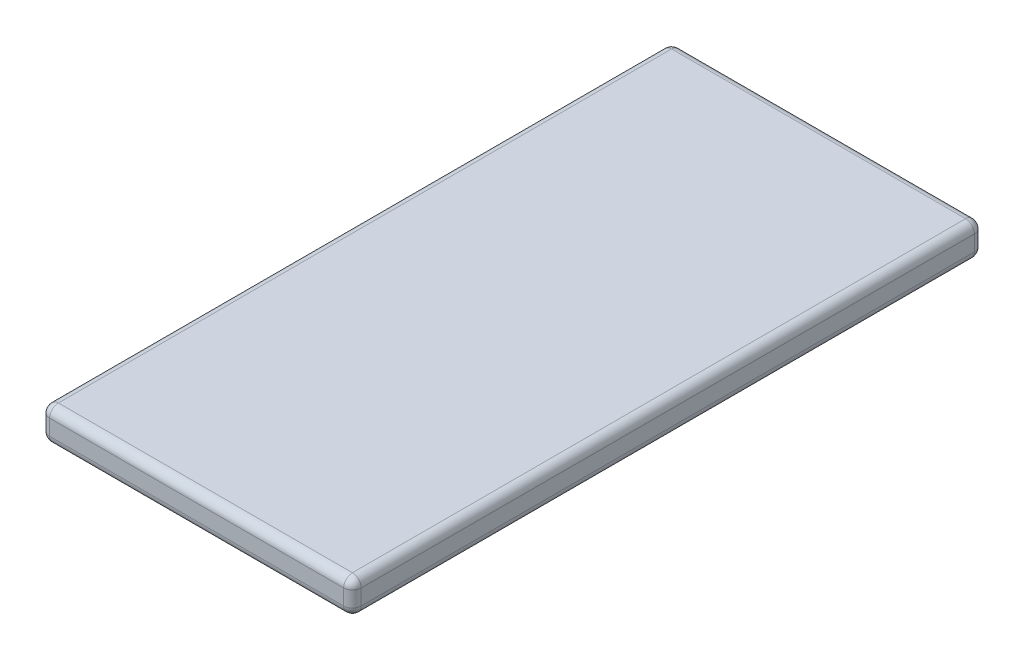
ISO-10303-21;
HEADER;
FILE_DESCRIPTION(('STEP AP214'),'2;1');
FILE_NAME('part.step','',(''),(''),'','','');
FILE_SCHEMA(('AUTOMOTIVE_DESIGN { 1 0 10303 214 1 1 1 1 }'));
ENDSEC;
DATA;
#1=APPLICATION_CONTEXT('core data for automotive mechanical design processes');
#2=APPLICATION_PROTOCOL_DEFINITION('international standard','automotive_design',2000,#1);
#3=PRODUCT_CONTEXT('',#1,'mechanical');
#4=PRODUCT('Part','Part','',(#3));
#5=PRODUCT_RELATED_PRODUCT_CATEGORY('part','',(#4));
#6=PRODUCT_DEFINITION_FORMATION('','',#4);
#7=PRODUCT_DEFINITION_CONTEXT('part definition',#1,'design');
#8=PRODUCT_DEFINITION('design','',#6,#7);
#9=PRODUCT_DEFINITION_SHAPE('','',#8);
#10=(LENGTH_UNIT() NAMED_UNIT(*) SI_UNIT(.MILLI.,.METRE.));
#11=(NAMED_UNIT(*) PLANE_ANGLE_UNIT() SI_UNIT($,.RADIAN.));
#12=(NAMED_UNIT(*) SI_UNIT($,.STERADIAN.) SOLID_ANGLE_UNIT());
#13=UNCERTAINTY_MEASURE_WITH_UNIT(LENGTH_MEASURE(1.E-05),#10,'distance_accuracy_value','');
#14=(GEOMETRIC_REPRESENTATION_CONTEXT(3) GLOBAL_UNCERTAINTY_ASSIGNED_CONTEXT((#13)) GLOBAL_UNIT_ASSIGNED_CONTEXT((#10,
#11,#12)) REPRESENTATION_CONTEXT('',''));
#15=CARTESIAN_POINT('',(0.,0.,0.));
#16=DIRECTION('',(0.,0.,1.));
#17=DIRECTION('',(1.,0.,0.));
#18=AXIS2_PLACEMENT_3D('',#15,#16,#17);
#19=CARTESIAN_POINT('',(35.47,7.56,71.795));
#20=DIRECTION('',(-1.,0.,0.));
#21=DIRECTION('',(0.,0.,1.));
#22=AXIS2_PLACEMENT_3D('',#19,#20,#21);
#23=PLANE('',#22);
#24=DIRECTION('',(0.,-1.,0.));
#25=VECTOR('',#24,1.);
#26=CARTESIAN_POINT('',(35.47,7.56,-69.795));
#27=LINE('',#26,#25);
#28=CARTESIAN_POINT('',(35.47,2.,-69.795));
#29=VERTEX_POINT('',#28);
#30=CARTESIAN_POINT('',(35.47,5.56,-69.795));
#31=VERTEX_POINT('',#30);
#32=EDGE_CURVE('E150',#29,#31,#27,.F.);
#33=ORIENTED_EDGE('',*,*,#32,.T.);
#34=DIRECTION('',(0.,0.,-1.));
#35=VECTOR('',#34,1.);
#36=CARTESIAN_POINT('',(35.47,5.56,71.795));
#37=LINE('',#36,#35);
#38=CARTESIAN_POINT('',(35.47,5.56,69.795));
#39=VERTEX_POINT('',#38);
#40=EDGE_CURVE('E153',#31,#39,#37,.F.);
#41=ORIENTED_EDGE('',*,*,#40,.T.);
#42=DIRECTION('',(0.,-1.,0.));
#43=VECTOR('',#42,1.);
#44=CARTESIAN_POINT('',(35.47,7.56,69.795));
#45=LINE('',#44,#43);
#46=CARTESIAN_POINT('',(35.47,2.,69.795));
#47=VERTEX_POINT('',#46);
#48=EDGE_CURVE('E127',#39,#47,#45,.T.);
#49=ORIENTED_EDGE('',*,*,#48,.T.);
#50=DIRECTION('',(0.,0.,-1.));
#51=VECTOR('',#50,1.);
#52=CARTESIAN_POINT('',(35.47,2.,-71.795));
#53=LINE('',#52,#51);
#54=EDGE_CURVE('E144',#47,#29,#53,.T.);
#55=ORIENTED_EDGE('',*,*,#54,.T.);
#56=EDGE_LOOP('',(#33,#41,#49,#55));
#57=FACE_BOUND('',#56,.T.);
#58=ADVANCED_FACE('F34',(#57),#23,.F.);
#59=CARTESIAN_POINT('',(-35.47,7.56,-71.795));
#60=DIRECTION('',(0.,0.,1.));
#61=DIRECTION('',(1.,0.,0.));
#62=AXIS2_PLACEMENT_3D('',#59,#60,#61);
#63=PLANE('',#62);
#64=DIRECTION('',(0.,-1.,0.));
#65=VECTOR('',#64,1.);
#66=CARTESIAN_POINT('',(-33.47,7.56,-71.795));
#67=LINE('',#66,#65);
#68=CARTESIAN_POINT('',(-33.47,2.,-71.795));
#69=VERTEX_POINT('',#68);
#70=CARTESIAN_POINT('',(-33.47,5.56,-71.795));
#71=VERTEX_POINT('',#70);
#72=EDGE_CURVE('E168',#69,#71,#67,.F.);
#73=ORIENTED_EDGE('',*,*,#72,.T.);
#74=DIRECTION('',(-1.,0.,0.));
#75=VECTOR('',#74,1.);
#76=CARTESIAN_POINT('',(-35.47,5.56,-71.795));
#77=LINE('',#76,#75);
#78=CARTESIAN_POINT('',(33.47,5.56,-71.795));
#79=VERTEX_POINT('',#78);
#80=EDGE_CURVE('E173',#71,#79,#77,.F.);
#81=ORIENTED_EDGE('',*,*,#80,.T.);
#82=DIRECTION('',(0.,-1.,0.));
#83=VECTOR('',#82,1.);
#84=CARTESIAN_POINT('',(33.47,7.56,-71.795));
#85=LINE('',#84,#83);
#86=CARTESIAN_POINT('',(33.47,2.,-71.795));
#87=VERTEX_POINT('',#86);
#88=EDGE_CURVE('E170',#79,#87,#85,.T.);
#89=ORIENTED_EDGE('',*,*,#88,.T.);
#90=DIRECTION('',(-1.,0.,0.));
#91=VECTOR('',#90,1.);
#92=CARTESIAN_POINT('',(-35.47,2.,-71.795));
#93=LINE('',#92,#91);
#94=EDGE_CURVE('E166',#87,#69,#93,.T.);
#95=ORIENTED_EDGE('',*,*,#94,.T.);
#96=EDGE_LOOP('',(#73,#81,#89,#95));
#97=FACE_BOUND('',#96,.T.);
#98=ADVANCED_FACE('F279',(#97),#63,.F.);
#99=CARTESIAN_POINT('',(-35.47,7.56,71.795));
#100=DIRECTION('',(1.,0.,0.));
#101=DIRECTION('',(0.,0.,-1.));
#102=AXIS2_PLACEMENT_3D('',#99,#100,#101);
#103=PLANE('',#102);
#104=DIRECTION('',(0.,-1.,0.));
#105=VECTOR('',#104,1.);
#106=CARTESIAN_POINT('',(-35.47,7.56,69.795));
#107=LINE('',#106,#105);
#108=CARTESIAN_POINT('',(-35.47,2.,69.795));
#109=VERTEX_POINT('',#108);
#110=CARTESIAN_POINT('',(-35.47,5.56,69.795));
#111=VERTEX_POINT('',#110);
#112=EDGE_CURVE('E177',#109,#111,#107,.F.);
#113=ORIENTED_EDGE('',*,*,#112,.T.);
#114=DIRECTION('',(0.,0.,1.));
#115=VECTOR('',#114,1.);
#116=CARTESIAN_POINT('',(-35.47,5.56,71.795));
#117=LINE('',#116,#115);
#118=CARTESIAN_POINT('',(-35.47,5.56,-69.795));
#119=VERTEX_POINT('',#118);
#120=EDGE_CURVE('E182',#111,#119,#117,.F.);
#121=ORIENTED_EDGE('',*,*,#120,.T.);
#122=DIRECTION('',(0.,-1.,0.));
#123=VECTOR('',#122,1.);
#124=CARTESIAN_POINT('',(-35.47,7.56,-69.795));
#125=LINE('',#124,#123);
#126=CARTESIAN_POINT('',(-35.47,2.,-69.795));
#127=VERTEX_POINT('',#126);
#128=EDGE_CURVE('E179',#119,#127,#125,.T.);
#129=ORIENTED_EDGE('',*,*,#128,.T.);
#130=DIRECTION('',(0.,0.,1.));
#131=VECTOR('',#130,1.);
#132=CARTESIAN_POINT('',(-35.47,2.,71.795));
#133=LINE('',#132,#131);
#134=EDGE_CURVE('E175',#127,#109,#133,.T.);
#135=ORIENTED_EDGE('',*,*,#134,.T.);
#136=EDGE_LOOP('',(#113,#121,#129,#135));
#137=FACE_BOUND('',#136,.T.);
#138=ADVANCED_FACE('F292',(#137),#103,.F.);
#139=CARTESIAN_POINT('',(-35.47,7.56,71.795));
#140=DIRECTION('',(0.,0.,-1.));
#141=DIRECTION('',(-1.,0.,0.));
#142=AXIS2_PLACEMENT_3D('',#139,#140,#141);
#143=PLANE('',#142);
#144=DIRECTION('',(0.,-1.,0.));
#145=VECTOR('',#144,1.);
#146=CARTESIAN_POINT('',(33.47,7.56,71.795));
#147=LINE('',#146,#145);
#148=CARTESIAN_POINT('',(33.47,2.,71.795));
#149=VERTEX_POINT('',#148);
#150=CARTESIAN_POINT('',(33.47,5.56,71.795));
#151=VERTEX_POINT('',#150);
#152=EDGE_CURVE('E129',#149,#151,#147,.F.);
#153=ORIENTED_EDGE('',*,*,#152,.T.);
#154=DIRECTION('',(1.,0.,0.));
#155=VECTOR('',#154,1.);
#156=CARTESIAN_POINT('',(-35.47,5.56,71.795));
#157=LINE('',#156,#155);
#158=CARTESIAN_POINT('',(-33.47,5.56,71.795));
#159=VERTEX_POINT('',#158);
#160=EDGE_CURVE('E164',#151,#159,#157,.F.);
#161=ORIENTED_EDGE('',*,*,#160,.T.);
#162=DIRECTION('',(0.,-1.,0.));
#163=VECTOR('',#162,1.);
#164=CARTESIAN_POINT('',(-33.47,7.56,71.795));
#165=LINE('',#164,#163);
#166=CARTESIAN_POINT('',(-33.47,2.,71.795));
#167=VERTEX_POINT('',#166);
#168=EDGE_CURVE('E161',#159,#167,#165,.T.);
#169=ORIENTED_EDGE('',*,*,#168,.T.);
#170=DIRECTION('',(1.,0.,0.));
#171=VECTOR('',#170,1.);
#172=CARTESIAN_POINT('',(35.47,2.,71.795));
#173=LINE('',#172,#171);
#174=EDGE_CURVE('E156',#167,#149,#173,.T.);
#175=ORIENTED_EDGE('',*,*,#174,.T.);
#176=EDGE_LOOP('',(#153,#161,#169,#175));
#177=FACE_BOUND('',#176,.T.);
#178=ADVANCED_FACE('F308',(#177),#143,.F.);
#179=CARTESIAN_POINT('',(0.,7.56,0.));
#180=DIRECTION('',(0.,-1.,0.));
#181=DIRECTION('',(0.,0.,-1.));
#182=AXIS2_PLACEMENT_3D('',#179,#180,#181);
#183=PLANE('',#182);
#184=DIRECTION('',(0.,0.,1.));
#185=VECTOR('',#184,1.);
#186=CARTESIAN_POINT('',(-33.47,7.56,0.));
#187=LINE('',#186,#185);
#188=CARTESIAN_POINT('',(-33.47,7.56,-69.795));
#189=VERTEX_POINT('',#188);
#190=CARTESIAN_POINT('',(-33.47,7.56,69.795));
#191=VERTEX_POINT('',#190);
#192=EDGE_CURVE('E188',#189,#191,#187,.T.);
#193=ORIENTED_EDGE('',*,*,#192,.T.);
#194=DIRECTION('',(1.,0.,0.));
#195=VECTOR('',#194,1.);
#196=CARTESIAN_POINT('',(0.,7.56,69.795));
#197=LINE('',#196,#195);
#198=CARTESIAN_POINT('',(33.47,7.56,69.795));
#199=VERTEX_POINT('',#198);
#200=EDGE_CURVE('E190',#191,#199,#197,.T.);
#201=ORIENTED_EDGE('',*,*,#200,.T.);
#202=DIRECTION('',(0.,0.,-1.));
#203=VECTOR('',#202,1.);
#204=CARTESIAN_POINT('',(33.47,7.56,0.));
#205=LINE('',#204,#203);
#206=CARTESIAN_POINT('',(33.47,7.56,-69.795));
#207=VERTEX_POINT('',#206);
#208=EDGE_CURVE('E184',#199,#207,#205,.T.);
#209=ORIENTED_EDGE('',*,*,#208,.T.);
#210=DIRECTION('',(-1.,0.,0.));
#211=VECTOR('',#210,1.);
#212=CARTESIAN_POINT('',(0.,7.56,-69.795));
#213=LINE('',#212,#211);
#214=EDGE_CURVE('E186',#207,#189,#213,.T.);
#215=ORIENTED_EDGE('',*,*,#214,.T.);
#216=EDGE_LOOP('',(#193,#201,#209,#215));
#217=FACE_BOUND('',#216,.T.);
#218=ADVANCED_FACE('F270',(#217),#183,.F.);
#219=CARTESIAN_POINT('',(0.,0.,0.));
#220=DIRECTION('',(0.,-1.,0.));
#221=DIRECTION('',(0.,0.,-1.));
#222=AXIS2_PLACEMENT_3D('',#219,#220,#221);
#223=PLANE('',#222);
#224=DIRECTION('',(0.,0.,1.));
#225=VECTOR('',#224,1.);
#226=CARTESIAN_POINT('',(-33.47,0.,-71.795));
#227=LINE('',#226,#225);
#228=CARTESIAN_POINT('',(-33.47,0.,69.795));
#229=VERTEX_POINT('',#228);
#230=CARTESIAN_POINT('',(-33.47,0.,-69.795));
#231=VERTEX_POINT('',#230);
#232=EDGE_CURVE('E43',#229,#231,#227,.F.);
#233=ORIENTED_EDGE('',*,*,#232,.T.);
#234=DIRECTION('',(-1.,0.,0.));
#235=VECTOR('',#234,1.);
#236=CARTESIAN_POINT('',(35.47,0.,-69.795));
#237=LINE('',#236,#235);
#238=CARTESIAN_POINT('',(33.47,0.,-69.795));
#239=VERTEX_POINT('',#238);
#240=EDGE_CURVE('E11',#231,#239,#237,.F.);
#241=ORIENTED_EDGE('',*,*,#240,.T.);
#242=DIRECTION('',(0.,0.,-1.));
#243=VECTOR('',#242,1.);
#244=CARTESIAN_POINT('',(33.47,0.,71.795));
#245=LINE('',#244,#243);
#246=CARTESIAN_POINT('',(33.47,0.,69.795));
#247=VERTEX_POINT('',#246);
#248=EDGE_CURVE('E193',#239,#247,#245,.F.);
#249=ORIENTED_EDGE('',*,*,#248,.T.);
#250=DIRECTION('',(1.,0.,0.));
#251=VECTOR('',#250,1.);
#252=CARTESIAN_POINT('',(-35.47,0.,69.795));
#253=LINE('',#252,#251);
#254=EDGE_CURVE('E54',#247,#229,#253,.F.);
#255=ORIENTED_EDGE('',*,*,#254,.T.);
#256=EDGE_LOOP('',(#233,#241,#249,#255));
#257=FACE_BOUND('',#256,.T.);
#258=ADVANCED_FACE('F479',(#257),#223,.T.);
#259=CARTESIAN_POINT('',(-33.47,7.56,-69.795));
#260=DIRECTION('',(0.,-1.,0.));
#261=DIRECTION('',(0.,0.,-1.));
#262=AXIS2_PLACEMENT_3D('',#259,#260,#261);
#263=CYLINDRICAL_SURFACE('',#262,2.);
#264=CARTESIAN_POINT('',(-33.47,5.56,-69.795));
#265=DIRECTION('',(0.,1.,0.));
#266=DIRECTION('',(0.,0.,1.));
#267=AXIS2_PLACEMENT_3D('',#264,#265,#266);
#268=CIRCLE('',#267,2.);
#269=EDGE_CURVE('E38',#71,#119,#268,.T.);
#270=ORIENTED_EDGE('',*,*,#269,.F.);
#271=ORIENTED_EDGE('',*,*,#72,.F.);
#272=CARTESIAN_POINT('',(-33.47,2.,-69.795));
#273=DIRECTION('',(0.,-1.,0.));
#274=DIRECTION('',(0.,0.,-1.));
#275=AXIS2_PLACEMENT_3D('',#272,#273,#274);
#276=CIRCLE('',#275,2.);
#277=EDGE_CURVE('E246',#127,#69,#276,.T.);
#278=ORIENTED_EDGE('',*,*,#277,.F.);
#279=ORIENTED_EDGE('',*,*,#128,.F.);
#280=EDGE_LOOP('',(#270,#271,#278,#279));
#281=FACE_BOUND('',#280,.T.);
#282=ADVANCED_FACE('F36',(#281),#263,.T.);
#283=CARTESIAN_POINT('',(-33.47,5.56,-69.795));
#284=DIRECTION('',(0.,0.,1.));
#285=DIRECTION('',(1.,0.,0.));
#286=AXIS2_PLACEMENT_3D('',#283,#284,#285);
#287=SPHERICAL_SURFACE('',#286,2.);
#288=CARTESIAN_POINT('',(-33.47,5.56,-69.795));
#289=DIRECTION('',(-1.,0.,0.));
#290=DIRECTION('',(0.,0.,1.));
#291=AXIS2_PLACEMENT_3D('',#288,#289,#290);
#292=CIRCLE('',#291,2.);
#293=EDGE_CURVE('E241',#71,#189,#292,.F.);
#294=ORIENTED_EDGE('',*,*,#293,.F.);
#295=ORIENTED_EDGE('',*,*,#269,.T.);
#296=CARTESIAN_POINT('',(-33.47,5.56,-69.795));
#297=DIRECTION('',(0.,0.,-1.));
#298=DIRECTION('',(-1.,0.,0.));
#299=AXIS2_PLACEMENT_3D('',#296,#297,#298);
#300=CIRCLE('',#299,2.);
#301=EDGE_CURVE('E244',#189,#119,#300,.F.);
#302=ORIENTED_EDGE('',*,*,#301,.F.);
#303=EDGE_LOOP('',(#294,#295,#302));
#304=FACE_BOUND('',#303,.T.);
#305=ADVANCED_FACE('F257',(#304),#287,.T.);
#306=CARTESIAN_POINT('',(-33.47,2.,-69.795));
#307=DIRECTION('',(0.,0.,1.));
#308=DIRECTION('',(1.,0.,0.));
#309=AXIS2_PLACEMENT_3D('',#306,#307,#308);
#310=SPHERICAL_SURFACE('',#309,2.);
#311=CARTESIAN_POINT('',(-33.47,2.,-69.795));
#312=DIRECTION('',(0.,0.,-1.));
#313=DIRECTION('',(-1.,0.,0.));
#314=AXIS2_PLACEMENT_3D('',#311,#312,#313);
#315=CIRCLE('',#314,2.);
#316=EDGE_CURVE('E236',#127,#231,#315,.F.);
#317=ORIENTED_EDGE('',*,*,#316,.F.);
#318=ORIENTED_EDGE('',*,*,#277,.T.);
#319=CARTESIAN_POINT('',(-33.47,2.,-69.795));
#320=DIRECTION('',(-1.,0.,0.));
#321=DIRECTION('',(0.,0.,1.));
#322=AXIS2_PLACEMENT_3D('',#319,#320,#321);
#323=CIRCLE('',#322,2.);
#324=EDGE_CURVE('E238',#231,#69,#323,.F.);
#325=ORIENTED_EDGE('',*,*,#324,.F.);
#326=EDGE_LOOP('',(#317,#318,#325));
#327=FACE_BOUND('',#326,.T.);
#328=ADVANCED_FACE('F458',(#327),#310,.T.);
#329=CARTESIAN_POINT('',(-33.47,5.56,0.));
#330=DIRECTION('',(0.,0.,1.));
#331=DIRECTION('',(1.,0.,0.));
#332=AXIS2_PLACEMENT_3D('',#329,#330,#331);
#333=CYLINDRICAL_SURFACE('',#332,2.);
#334=ORIENTED_EDGE('',*,*,#301,.T.);
#335=ORIENTED_EDGE('',*,*,#120,.F.);
#336=CARTESIAN_POINT('',(-33.47,5.56,69.795));
#337=DIRECTION('',(0.,0.,1.));
#338=DIRECTION('',(1.,0.,0.));
#339=AXIS2_PLACEMENT_3D('',#336,#337,#338);
#340=CIRCLE('',#339,2.);
#341=EDGE_CURVE('E230',#191,#111,#340,.T.);
#342=ORIENTED_EDGE('',*,*,#341,.F.);
#343=ORIENTED_EDGE('',*,*,#192,.F.);
#344=EDGE_LOOP('',(#334,#335,#342,#343));
#345=FACE_BOUND('',#344,.T.);
#346=ADVANCED_FACE('F265',(#345),#333,.T.);
#347=CARTESIAN_POINT('',(0.,5.56,-69.795));
#348=DIRECTION('',(-1.,0.,0.));
#349=DIRECTION('',(0.,0.,1.));
#350=AXIS2_PLACEMENT_3D('',#347,#348,#349);
#351=CYLINDRICAL_SURFACE('',#350,2.);
#352=ORIENTED_EDGE('',*,*,#293,.T.);
#353=ORIENTED_EDGE('',*,*,#214,.F.);
#354=CARTESIAN_POINT('',(33.47,5.56,-69.795));
#355=DIRECTION('',(1.,0.,0.));
#356=DIRECTION('',(0.,0.,-1.));
#357=AXIS2_PLACEMENT_3D('',#354,#355,#356);
#358=CIRCLE('',#357,2.);
#359=EDGE_CURVE('E227',#79,#207,#358,.T.);
#360=ORIENTED_EDGE('',*,*,#359,.F.);
#361=ORIENTED_EDGE('',*,*,#80,.F.);
#362=EDGE_LOOP('',(#352,#353,#360,#361));
#363=FACE_BOUND('',#362,.T.);
#364=ADVANCED_FACE('F276',(#363),#351,.T.);
#365=CARTESIAN_POINT('',(33.47,7.56,-69.795));
#366=DIRECTION('',(0.,-1.,0.));
#367=DIRECTION('',(0.,0.,-1.));
#368=AXIS2_PLACEMENT_3D('',#365,#366,#367);
#369=CYLINDRICAL_SURFACE('',#368,2.);
#370=CARTESIAN_POINT('',(33.47,2.,-69.795));
#371=DIRECTION('',(0.,-1.,0.));
#372=DIRECTION('',(0.,0.,-1.));
#373=AXIS2_PLACEMENT_3D('',#370,#371,#372);
#374=CIRCLE('',#373,2.);
#375=EDGE_CURVE('E221',#87,#29,#374,.T.);
#376=ORIENTED_EDGE('',*,*,#375,.F.);
#377=ORIENTED_EDGE('',*,*,#88,.F.);
#378=CARTESIAN_POINT('',(33.47,5.56,-69.795));
#379=DIRECTION('',(0.,1.,0.));
#380=DIRECTION('',(0.,0.,1.));
#381=AXIS2_PLACEMENT_3D('',#378,#379,#380);
#382=CIRCLE('',#381,2.);
#383=EDGE_CURVE('E224',#31,#79,#382,.T.);
#384=ORIENTED_EDGE('',*,*,#383,.F.);
#385=ORIENTED_EDGE('',*,*,#32,.F.);
#386=EDGE_LOOP('',(#376,#377,#384,#385));
#387=FACE_BOUND('',#386,.T.);
#388=ADVANCED_FACE('F283',(#387),#369,.T.);
#389=CARTESIAN_POINT('',(-35.47,2.,-69.795));
#390=DIRECTION('',(1.,0.,0.));
#391=DIRECTION('',(0.,0.,-1.));
#392=AXIS2_PLACEMENT_3D('',#389,#390,#391);
#393=CYLINDRICAL_SURFACE('',#392,2.);
#394=ORIENTED_EDGE('',*,*,#324,.T.);
#395=ORIENTED_EDGE('',*,*,#94,.F.);
#396=CARTESIAN_POINT('',(33.47,2.,-69.795));
#397=DIRECTION('',(1.,0.,0.));
#398=DIRECTION('',(0.,0.,-1.));
#399=AXIS2_PLACEMENT_3D('',#396,#397,#398);
#400=CIRCLE('',#399,2.);
#401=EDGE_CURVE('E219',#239,#87,#400,.T.);
#402=ORIENTED_EDGE('',*,*,#401,.F.);
#403=ORIENTED_EDGE('',*,*,#240,.F.);
#404=EDGE_LOOP('',(#394,#395,#402,#403));
#405=FACE_BOUND('',#404,.T.);
#406=ADVANCED_FACE('F289',(#405),#393,.T.);
#407=CARTESIAN_POINT('',(-33.47,2.,71.795));
#408=DIRECTION('',(0.,0.,-1.));
#409=DIRECTION('',(-1.,0.,0.));
#410=AXIS2_PLACEMENT_3D('',#407,#408,#409);
#411=CYLINDRICAL_SURFACE('',#410,2.);
#412=ORIENTED_EDGE('',*,*,#316,.T.);
#413=ORIENTED_EDGE('',*,*,#232,.F.);
#414=CARTESIAN_POINT('',(-33.47,2.,69.795));
#415=DIRECTION('',(0.,0.,1.));
#416=DIRECTION('',(1.,0.,0.));
#417=AXIS2_PLACEMENT_3D('',#414,#415,#416);
#418=CIRCLE('',#417,2.);
#419=EDGE_CURVE('E216',#109,#229,#418,.T.);
#420=ORIENTED_EDGE('',*,*,#419,.F.);
#421=ORIENTED_EDGE('',*,*,#134,.F.);
#422=EDGE_LOOP('',(#412,#413,#420,#421));
#423=FACE_BOUND('',#422,.T.);
#424=ADVANCED_FACE('F301',(#423),#411,.T.);
#425=CARTESIAN_POINT('',(-33.47,7.56,69.795));
#426=DIRECTION('',(0.,-1.,0.));
#427=DIRECTION('',(0.,0.,-1.));
#428=AXIS2_PLACEMENT_3D('',#425,#426,#427);
#429=CYLINDRICAL_SURFACE('',#428,2.);
#430=CARTESIAN_POINT('',(-33.47,5.56,69.795));
#431=DIRECTION('',(0.,1.,0.));
#432=DIRECTION('',(0.,0.,1.));
#433=AXIS2_PLACEMENT_3D('',#430,#431,#432);
#434=CIRCLE('',#433,2.);
#435=EDGE_CURVE('E233',#111,#159,#434,.T.);
#436=ORIENTED_EDGE('',*,*,#435,.F.);
#437=ORIENTED_EDGE('',*,*,#112,.F.);
#438=CARTESIAN_POINT('',(-33.47,2.,69.795));
#439=DIRECTION('',(0.,-1.,0.));
#440=DIRECTION('',(0.,0.,-1.));
#441=AXIS2_PLACEMENT_3D('',#438,#439,#440);
#442=CIRCLE('',#441,2.);
#443=EDGE_CURVE('E213',#167,#109,#442,.T.);
#444=ORIENTED_EDGE('',*,*,#443,.F.);
#445=ORIENTED_EDGE('',*,*,#168,.F.);
#446=EDGE_LOOP('',(#436,#437,#444,#445));
#447=FACE_BOUND('',#446,.T.);
#448=ADVANCED_FACE('F297',(#447),#429,.T.);
#449=CARTESIAN_POINT('',(-33.47,5.56,69.795));
#450=DIRECTION('',(0.,0.,1.));
#451=DIRECTION('',(1.,0.,0.));
#452=AXIS2_PLACEMENT_3D('',#449,#450,#451);
#453=SPHERICAL_SURFACE('',#452,2.);
#454=ORIENTED_EDGE('',*,*,#341,.T.);
#455=ORIENTED_EDGE('',*,*,#435,.T.);
#456=CARTESIAN_POINT('',(-33.47,5.56,69.795));
#457=DIRECTION('',(-1.,0.,0.));
#458=DIRECTION('',(0.,0.,1.));
#459=AXIS2_PLACEMENT_3D('',#456,#457,#458);
#460=CIRCLE('',#459,2.);
#461=EDGE_CURVE('E210',#191,#159,#460,.F.);
#462=ORIENTED_EDGE('',*,*,#461,.F.);
#463=EDGE_LOOP('',(#454,#455,#462));
#464=FACE_BOUND('',#463,.T.);
#465=ADVANCED_FACE('F311',(#464),#453,.T.);
#466=CARTESIAN_POINT('',(33.47,5.56,-69.795));
#467=DIRECTION('',(0.,0.,1.));
#468=DIRECTION('',(1.,0.,0.));
#469=AXIS2_PLACEMENT_3D('',#466,#467,#468);
#470=SPHERICAL_SURFACE('',#469,2.);
#471=ORIENTED_EDGE('',*,*,#383,.T.);
#472=ORIENTED_EDGE('',*,*,#359,.T.);
#473=CARTESIAN_POINT('',(33.47,5.56,-69.795));
#474=DIRECTION('',(0.,0.,-1.));
#475=DIRECTION('',(-1.,0.,0.));
#476=AXIS2_PLACEMENT_3D('',#473,#474,#475);
#477=CIRCLE('',#476,2.);
#478=EDGE_CURVE('E207',#31,#207,#477,.F.);
#479=ORIENTED_EDGE('',*,*,#478,.F.);
#480=EDGE_LOOP('',(#471,#472,#479));
#481=FACE_BOUND('',#480,.T.);
#482=ADVANCED_FACE('F320',(#481),#470,.T.);
#483=CARTESIAN_POINT('',(33.47,2.,-69.795));
#484=DIRECTION('',(0.,0.,1.));
#485=DIRECTION('',(1.,0.,0.));
#486=AXIS2_PLACEMENT_3D('',#483,#484,#485);
#487=SPHERICAL_SURFACE('',#486,2.);
#488=ORIENTED_EDGE('',*,*,#401,.T.);
#489=ORIENTED_EDGE('',*,*,#375,.T.);
#490=CARTESIAN_POINT('',(33.47,2.,-69.795));
#491=DIRECTION('',(0.,0.,-1.));
#492=DIRECTION('',(-1.,0.,0.));
#493=AXIS2_PLACEMENT_3D('',#490,#491,#492);
#494=CIRCLE('',#493,2.);
#495=EDGE_CURVE('E147',#239,#29,#494,.F.);
#496=ORIENTED_EDGE('',*,*,#495,.F.);
#497=EDGE_LOOP('',(#488,#489,#496));
#498=FACE_BOUND('',#497,.T.);
#499=ADVANCED_FACE('F322',(#498),#487,.T.);
#500=CARTESIAN_POINT('',(-33.47,2.,69.795));
#501=DIRECTION('',(0.,0.,1.));
#502=DIRECTION('',(1.,0.,0.));
#503=AXIS2_PLACEMENT_3D('',#500,#501,#502);
#504=SPHERICAL_SURFACE('',#503,2.);
#505=ORIENTED_EDGE('',*,*,#443,.T.);
#506=ORIENTED_EDGE('',*,*,#419,.T.);
#507=CARTESIAN_POINT('',(-33.47,2.,69.795));
#508=DIRECTION('',(-1.,0.,0.));
#509=DIRECTION('',(0.,0.,1.));
#510=AXIS2_PLACEMENT_3D('',#507,#508,#509);
#511=CIRCLE('',#510,2.);
#512=EDGE_CURVE('E203',#167,#229,#511,.F.);
#513=ORIENTED_EDGE('',*,*,#512,.F.);
#514=EDGE_LOOP('',(#505,#506,#513));
#515=FACE_BOUND('',#514,.T.);
#516=ADVANCED_FACE('F303',(#515),#504,.T.);
#517=CARTESIAN_POINT('',(0.,5.56,69.795));
#518=DIRECTION('',(1.,0.,0.));
#519=DIRECTION('',(0.,0.,-1.));
#520=AXIS2_PLACEMENT_3D('',#517,#518,#519);
#521=CYLINDRICAL_SURFACE('',#520,2.);
#522=ORIENTED_EDGE('',*,*,#461,.T.);
#523=ORIENTED_EDGE('',*,*,#160,.F.);
#524=CARTESIAN_POINT('',(33.47,5.56,69.795));
#525=DIRECTION('',(1.,0.,0.));
#526=DIRECTION('',(0.,0.,-1.));
#527=AXIS2_PLACEMENT_3D('',#524,#525,#526);
#528=CIRCLE('',#527,2.);
#529=EDGE_CURVE('E200',#199,#151,#528,.T.);
#530=ORIENTED_EDGE('',*,*,#529,.F.);
#531=ORIENTED_EDGE('',*,*,#200,.F.);
#532=EDGE_LOOP('',(#522,#523,#530,#531));
#533=FACE_BOUND('',#532,.T.);
#534=ADVANCED_FACE('F313',(#533),#521,.T.);
#535=CARTESIAN_POINT('',(33.47,5.56,0.));
#536=DIRECTION('',(0.,0.,-1.));
#537=DIRECTION('',(-1.,0.,0.));
#538=AXIS2_PLACEMENT_3D('',#535,#536,#537);
#539=CYLINDRICAL_SURFACE('',#538,2.);
#540=ORIENTED_EDGE('',*,*,#478,.T.);
#541=ORIENTED_EDGE('',*,*,#208,.F.);
#542=CARTESIAN_POINT('',(33.47,5.56,69.795));
#543=DIRECTION('',(0.,0.,1.));
#544=DIRECTION('',(1.,0.,0.));
#545=AXIS2_PLACEMENT_3D('',#542,#543,#544);
#546=CIRCLE('',#545,2.);
#547=EDGE_CURVE('E141',#39,#199,#546,.T.);
#548=ORIENTED_EDGE('',*,*,#547,.F.);
#549=ORIENTED_EDGE('',*,*,#40,.F.);
#550=EDGE_LOOP('',(#540,#541,#548,#549));
#551=FACE_BOUND('',#550,.T.);
#552=ADVANCED_FACE('F318',(#551),#539,.T.);
#553=CARTESIAN_POINT('',(33.47,2.,71.795));
#554=DIRECTION('',(0.,0.,1.));
#555=DIRECTION('',(1.,0.,0.));
#556=AXIS2_PLACEMENT_3D('',#553,#554,#555);
#557=CYLINDRICAL_SURFACE('',#556,2.);
#558=ORIENTED_EDGE('',*,*,#495,.T.);
#559=ORIENTED_EDGE('',*,*,#54,.F.);
#560=CARTESIAN_POINT('',(33.47,2.,69.795));
#561=DIRECTION('',(0.,0.,1.));
#562=DIRECTION('',(1.,0.,0.));
#563=AXIS2_PLACEMENT_3D('',#560,#561,#562);
#564=CIRCLE('',#563,2.);
#565=EDGE_CURVE('E135',#247,#47,#564,.T.);
#566=ORIENTED_EDGE('',*,*,#565,.F.);
#567=ORIENTED_EDGE('',*,*,#248,.F.);
#568=EDGE_LOOP('',(#558,#559,#566,#567));
#569=FACE_BOUND('',#568,.T.);
#570=ADVANCED_FACE('F145',(#569),#557,.T.);
#571=CARTESIAN_POINT('',(-35.47,2.,69.795));
#572=DIRECTION('',(-1.,0.,0.));
#573=DIRECTION('',(0.,0.,1.));
#574=AXIS2_PLACEMENT_3D('',#571,#572,#573);
#575=CYLINDRICAL_SURFACE('',#574,2.);
#576=ORIENTED_EDGE('',*,*,#512,.T.);
#577=ORIENTED_EDGE('',*,*,#254,.F.);
#578=CARTESIAN_POINT('',(33.47,2.,69.795));
#579=DIRECTION('',(1.,0.,0.));
#580=DIRECTION('',(0.,0.,-1.));
#581=AXIS2_PLACEMENT_3D('',#578,#579,#580);
#582=CIRCLE('',#581,2.);
#583=EDGE_CURVE('E139',#149,#247,#582,.T.);
#584=ORIENTED_EDGE('',*,*,#583,.F.);
#585=ORIENTED_EDGE('',*,*,#174,.F.);
#586=EDGE_LOOP('',(#576,#577,#584,#585));
#587=FACE_BOUND('',#586,.T.);
#588=ADVANCED_FACE('F306',(#587),#575,.T.);
#589=CARTESIAN_POINT('',(33.47,5.56,69.795));
#590=DIRECTION('',(0.,0.,1.));
#591=DIRECTION('',(1.,0.,0.));
#592=AXIS2_PLACEMENT_3D('',#589,#590,#591);
#593=SPHERICAL_SURFACE('',#592,2.);
#594=ORIENTED_EDGE('',*,*,#547,.T.);
#595=ORIENTED_EDGE('',*,*,#529,.T.);
#596=CARTESIAN_POINT('',(33.47,5.56,69.795));
#597=DIRECTION('',(0.,1.,0.));
#598=DIRECTION('',(0.,0.,1.));
#599=AXIS2_PLACEMENT_3D('',#596,#597,#598);
#600=CIRCLE('',#599,2.);
#601=EDGE_CURVE('E132',#39,#151,#600,.F.);
#602=ORIENTED_EDGE('',*,*,#601,.F.);
#603=EDGE_LOOP('',(#594,#595,#602));
#604=FACE_BOUND('',#603,.T.);
#605=ADVANCED_FACE('F342',(#604),#593,.T.);
#606=CARTESIAN_POINT('',(33.47,2.,69.795));
#607=DIRECTION('',(0.,0.,1.));
#608=DIRECTION('',(1.,0.,0.));
#609=AXIS2_PLACEMENT_3D('',#606,#607,#608);
#610=SPHERICAL_SURFACE('',#609,2.);
#611=ORIENTED_EDGE('',*,*,#583,.T.);
#612=ORIENTED_EDGE('',*,*,#565,.T.);
#613=CARTESIAN_POINT('',(33.47,2.,69.795));
#614=DIRECTION('',(0.,-1.,0.));
#615=DIRECTION('',(0.,0.,-1.));
#616=AXIS2_PLACEMENT_3D('',#613,#614,#615);
#617=CIRCLE('',#616,2.);
#618=EDGE_CURVE('E123',#149,#47,#617,.F.);
#619=ORIENTED_EDGE('',*,*,#618,.F.);
#620=EDGE_LOOP('',(#611,#612,#619));
#621=FACE_BOUND('',#620,.T.);
#622=ADVANCED_FACE('F137',(#621),#610,.T.);
#623=CARTESIAN_POINT('',(33.47,7.56,69.795));
#624=DIRECTION('',(0.,-1.,0.));
#625=DIRECTION('',(0.,0.,-1.));
#626=AXIS2_PLACEMENT_3D('',#623,#624,#625);
#627=CYLINDRICAL_SURFACE('',#626,2.);
#628=ORIENTED_EDGE('',*,*,#601,.T.);
#629=ORIENTED_EDGE('',*,*,#152,.F.);
#630=ORIENTED_EDGE('',*,*,#618,.T.);
#631=ORIENTED_EDGE('',*,*,#48,.F.);
#632=EDGE_LOOP('',(#628,#629,#630,#631));
#633=FACE_BOUND('',#632,.T.);
#634=ADVANCED_FACE('F125',(#633),#627,.T.);
#635=CLOSED_SHELL('',(#58,#98,#138,#178,#218,#258,#282,#305,#328,#346,#364,#388,#406,#424,#448,
#465,#482,#499,#516,#534,#552,#570,#588,#605,#622,#634));
#636=MANIFOLD_SOLID_BREP('B2',#635);
#637=ADVANCED_BREP_SHAPE_REPRESENTATION('',(#18,#636),#14);
#638=SHAPE_DEFINITION_REPRESENTATION(#9,#637);
ENDSEC;
END-ISO-10303-21;
